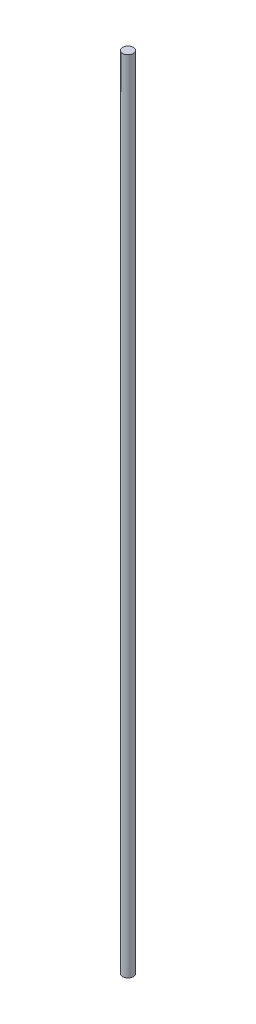
ISO-10303-21;
HEADER;
FILE_DESCRIPTION(('STEP AP214'),'2;1');
FILE_NAME('part.step','',(''),(''),'','','');
FILE_SCHEMA(('AUTOMOTIVE_DESIGN { 1 0 10303 214 1 1 1 1 }'));
ENDSEC;
DATA;
#1=APPLICATION_CONTEXT('core data for automotive mechanical design processes');
#2=APPLICATION_PROTOCOL_DEFINITION('international standard','automotive_design',2000,#1);
#3=PRODUCT_CONTEXT('',#1,'mechanical');
#4=PRODUCT('Part','Part','',(#3));
#5=PRODUCT_RELATED_PRODUCT_CATEGORY('part','',(#4));
#6=PRODUCT_DEFINITION_FORMATION('','',#4);
#7=PRODUCT_DEFINITION_CONTEXT('part definition',#1,'design');
#8=PRODUCT_DEFINITION('design','',#6,#7);
#9=PRODUCT_DEFINITION_SHAPE('','',#8);
#10=(LENGTH_UNIT() NAMED_UNIT(*) SI_UNIT(.MILLI.,.METRE.));
#11=(NAMED_UNIT(*) PLANE_ANGLE_UNIT() SI_UNIT($,.RADIAN.));
#12=(NAMED_UNIT(*) SI_UNIT($,.STERADIAN.) SOLID_ANGLE_UNIT());
#13=UNCERTAINTY_MEASURE_WITH_UNIT(LENGTH_MEASURE(1.E-05),#10,'distance_accuracy_value','');
#14=(GEOMETRIC_REPRESENTATION_CONTEXT(3) GLOBAL_UNCERTAINTY_ASSIGNED_CONTEXT((#13)) GLOBAL_UNIT_ASSIGNED_CONTEXT((#10,
#11,#12)) REPRESENTATION_CONTEXT('',''));
#15=CARTESIAN_POINT('',(0.,0.,0.));
#16=DIRECTION('',(0.,0.,1.));
#17=DIRECTION('',(1.,0.,0.));
#18=AXIS2_PLACEMENT_3D('',#15,#16,#17);
#19=CARTESIAN_POINT('',(0.,475.,0.));
#20=DIRECTION('',(0.,-1.,0.));
#21=DIRECTION('',(0.,0.,-1.));
#22=AXIS2_PLACEMENT_3D('',#19,#20,#21);
#23=CYLINDRICAL_SURFACE('',#22,3.175);
#24=CARTESIAN_POINT('',(0.,475.,0.));
#25=DIRECTION('',(0.,1.,0.));
#26=DIRECTION('',(0.,0.,1.));
#27=AXIS2_PLACEMENT_3D('',#24,#25,#26);
#28=CIRCLE('',#27,3.175);
#29=CARTESIAN_POINT('',(0.,475.,3.175));
#30=VERTEX_POINT('',#29);
#31=EDGE_CURVE('E10',#30,#30,#28,.T.);
#32=ORIENTED_EDGE('',*,*,#31,.F.);
#33=EDGE_LOOP('',(#32));
#34=FACE_BOUND('',#33,.T.);
#35=CARTESIAN_POINT('',(0.,0.,0.));
#36=DIRECTION('',(0.,1.,0.));
#37=DIRECTION('',(0.,0.,1.));
#38=AXIS2_PLACEMENT_3D('',#35,#36,#37);
#39=CIRCLE('',#38,3.175);
#40=CARTESIAN_POINT('',(0.,0.,3.175));
#41=VERTEX_POINT('',#40);
#42=EDGE_CURVE('E42',#41,#41,#39,.T.);
#43=ORIENTED_EDGE('',*,*,#42,.T.);
#44=EDGE_LOOP('',(#43));
#45=FACE_BOUND('',#44,.T.);
#46=ADVANCED_FACE('F39',(#34,#45),#23,.T.);
#47=CARTESIAN_POINT('',(0.,475.,0.));
#48=DIRECTION('',(0.,1.,0.));
#49=DIRECTION('',(0.,0.,1.));
#50=AXIS2_PLACEMENT_3D('',#47,#48,#49);
#51=PLANE('',#50);
#52=ORIENTED_EDGE('',*,*,#31,.T.);
#53=EDGE_LOOP('',(#52));
#54=FACE_BOUND('',#53,.T.);
#55=ADVANCED_FACE('F56',(#54),#51,.T.);
#56=CARTESIAN_POINT('',(0.,0.,0.));
#57=DIRECTION('',(0.,1.,0.));
#58=DIRECTION('',(0.,0.,1.));
#59=AXIS2_PLACEMENT_3D('',#56,#57,#58);
#60=PLANE('',#59);
#61=ORIENTED_EDGE('',*,*,#42,.F.);
#62=EDGE_LOOP('',(#61));
#63=FACE_BOUND('',#62,.T.);
#64=ADVANCED_FACE('F54',(#63),#60,.F.);
#65=CLOSED_SHELL('',(#46,#55,#64));
#66=MANIFOLD_SOLID_BREP('B2',#65);
#67=ADVANCED_BREP_SHAPE_REPRESENTATION('',(#18,#66),#14);
#68=SHAPE_DEFINITION_REPRESENTATION(#9,#67);
ENDSEC;
END-ISO-10303-21;
